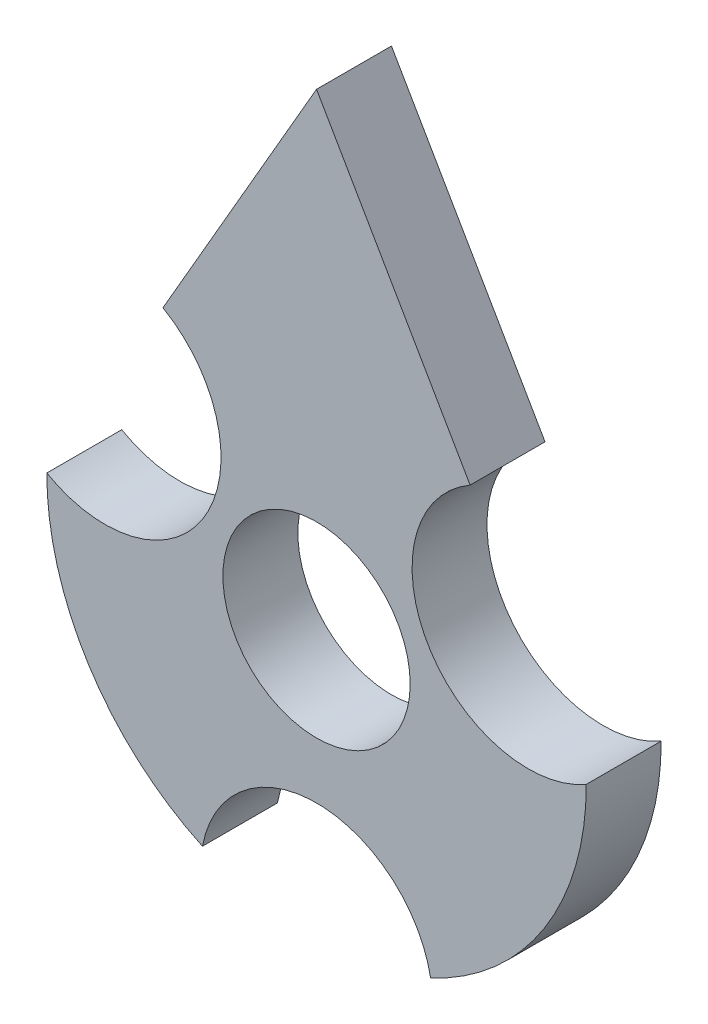
ISO-10303-21;
HEADER;
FILE_DESCRIPTION(('STEP AP214'),'2;1');
FILE_NAME('part.step','',(''),(''),'','','');
FILE_SCHEMA(('AUTOMOTIVE_DESIGN { 1 0 10303 214 1 1 1 1 }'));
ENDSEC;
DATA;
#1=APPLICATION_CONTEXT('core data for automotive mechanical design processes');
#2=APPLICATION_PROTOCOL_DEFINITION('international standard','automotive_design',2000,#1);
#3=PRODUCT_CONTEXT('',#1,'mechanical');
#4=PRODUCT('Part','Part','',(#3));
#5=PRODUCT_RELATED_PRODUCT_CATEGORY('part','',(#4));
#6=PRODUCT_DEFINITION_FORMATION('','',#4);
#7=PRODUCT_DEFINITION_CONTEXT('part definition',#1,'design');
#8=PRODUCT_DEFINITION('design','',#6,#7);
#9=PRODUCT_DEFINITION_SHAPE('','',#8);
#10=(LENGTH_UNIT() NAMED_UNIT(*) SI_UNIT(.MILLI.,.METRE.));
#11=(NAMED_UNIT(*) PLANE_ANGLE_UNIT() SI_UNIT($,.RADIAN.));
#12=(NAMED_UNIT(*) SI_UNIT($,.STERADIAN.) SOLID_ANGLE_UNIT());
#13=UNCERTAINTY_MEASURE_WITH_UNIT(LENGTH_MEASURE(1.E-05),#10,'distance_accuracy_value','');
#14=(GEOMETRIC_REPRESENTATION_CONTEXT(3) GLOBAL_UNCERTAINTY_ASSIGNED_CONTEXT((#13)) GLOBAL_UNIT_ASSIGNED_CONTEXT((#10,
#11,#12)) REPRESENTATION_CONTEXT('',''));
#15=CARTESIAN_POINT('',(0.,0.,0.));
#16=DIRECTION('',(0.,0.,1.));
#17=DIRECTION('',(1.,0.,0.));
#18=AXIS2_PLACEMENT_3D('',#15,#16,#17);
#19=CARTESIAN_POINT('',(0.,-71.,10.));
#20=DIRECTION('',(0.,0.,-1.));
#21=DIRECTION('',(-1.,0.,0.));
#22=AXIS2_PLACEMENT_3D('',#19,#20,#21);
#23=CYLINDRICAL_SURFACE('',#22,31.);
#24=CARTESIAN_POINT('',(0.,-71.,-10.));
#25=DIRECTION('',(0.,0.,1.));
#26=DIRECTION('',(1.,0.,0.));
#27=AXIS2_PLACEMENT_3D('',#24,#25,#26);
#28=CIRCLE('',#27,31.);
#29=CARTESIAN_POINT('',(30.4600707409185,-65.2394366197183,-10.));
#30=VERTEX_POINT('',#29);
#31=CARTESIAN_POINT('',(-30.4600707409185,-65.2394366197183,-10.));
#32=VERTEX_POINT('',#31);
#33=EDGE_CURVE('E140',#30,#32,#28,.T.);
#34=ORIENTED_EDGE('',*,*,#33,.F.);
#35=DIRECTION('',(0.,0.,-1.));
#36=VECTOR('',#35,1.);
#37=CARTESIAN_POINT('',(30.4600707409185,-65.2394366197183,10.));
#38=LINE('',#37,#36);
#39=CARTESIAN_POINT('',(30.4600707409185,-65.2394366197183,10.));
#40=VERTEX_POINT('',#39);
#41=EDGE_CURVE('E11',#40,#30,#38,.T.);
#42=ORIENTED_EDGE('',*,*,#41,.F.);
#43=CARTESIAN_POINT('',(0.,-71.,10.));
#44=DIRECTION('',(0.,0.,1.));
#45=DIRECTION('',(1.,0.,0.));
#46=AXIS2_PLACEMENT_3D('',#43,#44,#45);
#47=CIRCLE('',#46,31.);
#48=CARTESIAN_POINT('',(-30.4600707409185,-65.2394366197183,10.));
#49=VERTEX_POINT('',#48);
#50=EDGE_CURVE('E187',#40,#49,#47,.T.);
#51=ORIENTED_EDGE('',*,*,#50,.T.);
#52=DIRECTION('',(0.,0.,-1.));
#53=VECTOR('',#52,1.);
#54=CARTESIAN_POINT('',(-30.4600707409185,-65.2394366197183,10.));
#55=LINE('',#54,#53);
#56=EDGE_CURVE('E81',#49,#32,#55,.T.);
#57=ORIENTED_EDGE('',*,*,#56,.T.);
#58=EDGE_LOOP('',(#34,#42,#51,#57));
#59=FACE_BOUND('',#58,.T.);
#60=ADVANCED_FACE('F33',(#59),#23,.F.);
#61=CARTESIAN_POINT('',(0.,0.,10.));
#62=DIRECTION('',(0.,0.,-1.));
#63=DIRECTION('',(-1.,0.,0.));
#64=AXIS2_PLACEMENT_3D('',#61,#62,#63);
#65=CYLINDRICAL_SURFACE('',#64,72.);
#66=CARTESIAN_POINT('',(0.,0.,-10.));
#67=DIRECTION('',(0.,0.,1.));
#68=DIRECTION('',(1.,0.,0.));
#69=AXIS2_PLACEMENT_3D('',#66,#67,#68);
#70=CIRCLE('',#69,72.);
#71=CARTESIAN_POINT('',(71.9994078864265,0.292000006815826,-10.));
#72=VERTEX_POINT('',#71);
#73=EDGE_CURVE('E138',#30,#72,#70,.T.);
#74=ORIENTED_EDGE('',*,*,#73,.T.);
#75=DIRECTION('',(0.,0.,-1.));
#76=VECTOR('',#75,1.);
#77=CARTESIAN_POINT('',(71.9994078864265,0.292000006815826,10.));
#78=LINE('',#77,#76);
#79=CARTESIAN_POINT('',(71.9994078864265,0.292000006815826,10.));
#80=VERTEX_POINT('',#79);
#81=EDGE_CURVE('E42',#80,#72,#78,.T.);
#82=ORIENTED_EDGE('',*,*,#81,.F.);
#83=CARTESIAN_POINT('',(0.,0.,10.));
#84=DIRECTION('',(0.,0.,1.));
#85=DIRECTION('',(1.,0.,0.));
#86=AXIS2_PLACEMENT_3D('',#83,#84,#85);
#87=CIRCLE('',#86,72.);
#88=EDGE_CURVE('E189',#40,#80,#87,.T.);
#89=ORIENTED_EDGE('',*,*,#88,.F.);
#90=ORIENTED_EDGE('',*,*,#41,.T.);
#91=EDGE_LOOP('',(#74,#82,#89,#90));
#92=FACE_BOUND('',#91,.T.);
#93=ADVANCED_FACE('F139',(#92),#65,.T.);
#94=CARTESIAN_POINT('',(56.5000000000001,27.1391293723585,10.));
#95=DIRECTION('',(0.,0.,-1.));
#96=DIRECTION('',(-1.,0.,0.));
#97=AXIS2_PLACEMENT_3D('',#94,#95,#96);
#98=CYLINDRICAL_SURFACE('',#97,31.);
#99=CARTESIAN_POINT('',(56.5000000000001,27.1391293723585,-10.));
#100=DIRECTION('',(0.,0.,1.));
#101=DIRECTION('',(1.,0.,0.));
#102=AXIS2_PLACEMENT_3D('',#99,#100,#101);
#103=CIRCLE('',#102,31.);
#104=CARTESIAN_POINT('',(41.0000000000001,53.9859168896761,-10.));
#105=VERTEX_POINT('',#104);
#106=EDGE_CURVE('E133',#105,#72,#103,.T.);
#107=ORIENTED_EDGE('',*,*,#106,.F.);
#108=DIRECTION('',(0.,0.,-1.));
#109=VECTOR('',#108,1.);
#110=CARTESIAN_POINT('',(41.0000000000001,53.9859168896761,10.));
#111=LINE('',#110,#109);
#112=CARTESIAN_POINT('',(41.0000000000001,53.9859168896761,10.));
#113=VERTEX_POINT('',#112);
#114=EDGE_CURVE('E121',#113,#105,#111,.T.);
#115=ORIENTED_EDGE('',*,*,#114,.F.);
#116=CARTESIAN_POINT('',(56.5000000000001,27.1391293723585,10.));
#117=DIRECTION('',(0.,0.,1.));
#118=DIRECTION('',(1.,0.,0.));
#119=AXIS2_PLACEMENT_3D('',#116,#117,#118);
#120=CIRCLE('',#119,31.);
#121=EDGE_CURVE('E135',#113,#80,#120,.T.);
#122=ORIENTED_EDGE('',*,*,#121,.T.);
#123=ORIENTED_EDGE('',*,*,#81,.T.);
#124=EDGE_LOOP('',(#107,#115,#122,#123));
#125=FACE_BOUND('',#124,.T.);
#126=ADVANCED_FACE('F131',(#125),#98,.F.);
#127=CARTESIAN_POINT('',(54.1265877365275,31.2500000000001,10.));
#128=DIRECTION('',(0.866025403784438,0.500000000000001,0.));
#129=DIRECTION('',(-0.500000000000001,0.866025403784438,0.));
#130=AXIS2_PLACEMENT_3D('',#127,#128,#129);
#131=PLANE('',#130);
#132=DIRECTION('',(0.500000000000001,-0.866025403784438,0.));
#133=VECTOR('',#132,1.);
#134=CARTESIAN_POINT('',(54.1265877365275,31.2500000000001,-10.));
#135=LINE('',#134,#133);
#136=CARTESIAN_POINT('',(0.,125.,-10.));
#137=VERTEX_POINT('',#136);
#138=EDGE_CURVE('E144',#137,#105,#135,.T.);
#139=ORIENTED_EDGE('',*,*,#138,.F.);
#140=DIRECTION('',(0.,0.,-1.));
#141=VECTOR('',#140,1.);
#142=CARTESIAN_POINT('',(0.,125.,10.));
#143=LINE('',#142,#141);
#144=CARTESIAN_POINT('',(0.,125.,10.));
#145=VERTEX_POINT('',#144);
#146=EDGE_CURVE('E119',#145,#137,#143,.T.);
#147=ORIENTED_EDGE('',*,*,#146,.F.);
#148=DIRECTION('',(0.500000000000001,-0.866025403784438,0.));
#149=VECTOR('',#148,1.);
#150=CARTESIAN_POINT('',(54.1265877365275,31.2500000000001,10.));
#151=LINE('',#150,#149);
#152=EDGE_CURVE('E113',#145,#113,#151,.T.);
#153=ORIENTED_EDGE('',*,*,#152,.T.);
#154=ORIENTED_EDGE('',*,*,#114,.T.);
#155=EDGE_LOOP('',(#139,#147,#153,#154));
#156=FACE_BOUND('',#155,.T.);
#157=ADVANCED_FACE('F165',(#156),#131,.T.);
#158=CARTESIAN_POINT('',(-54.1265877365275,31.2500000000002,10.));
#159=DIRECTION('',(0.866025403784438,-0.500000000000001,0.));
#160=DIRECTION('',(0.500000000000001,0.866025403784438,0.));
#161=AXIS2_PLACEMENT_3D('',#158,#159,#160);
#162=PLANE('',#161);
#163=DIRECTION('',(-0.500000000000001,-0.866025403784438,0.));
#164=VECTOR('',#163,1.);
#165=CARTESIAN_POINT('',(-54.1265877365275,31.2500000000002,-10.));
#166=LINE('',#165,#164);
#167=CARTESIAN_POINT('',(-41.0000000000001,53.9859168896761,-10.));
#168=VERTEX_POINT('',#167);
#169=EDGE_CURVE('E118',#137,#168,#166,.T.);
#170=ORIENTED_EDGE('',*,*,#169,.T.);
#171=DIRECTION('',(0.,0.,-1.));
#172=VECTOR('',#171,1.);
#173=CARTESIAN_POINT('',(-41.0000000000001,53.9859168896761,10.));
#174=LINE('',#173,#172);
#175=CARTESIAN_POINT('',(-41.0000000000001,53.9859168896761,10.));
#176=VERTEX_POINT('',#175);
#177=EDGE_CURVE('E103',#176,#168,#174,.T.);
#178=ORIENTED_EDGE('',*,*,#177,.F.);
#179=DIRECTION('',(-0.500000000000001,-0.866025403784438,0.));
#180=VECTOR('',#179,1.);
#181=CARTESIAN_POINT('',(-54.1265877365275,31.2500000000002,10.));
#182=LINE('',#181,#180);
#183=EDGE_CURVE('E106',#145,#176,#182,.T.);
#184=ORIENTED_EDGE('',*,*,#183,.F.);
#185=ORIENTED_EDGE('',*,*,#146,.T.);
#186=EDGE_LOOP('',(#170,#178,#184,#185));
#187=FACE_BOUND('',#186,.T.);
#188=ADVANCED_FACE('F116',(#187),#162,.F.);
#189=CARTESIAN_POINT('',(-56.5000000000001,27.1391293723585,10.));
#190=DIRECTION('',(0.,0.,-1.));
#191=DIRECTION('',(-1.,0.,0.));
#192=AXIS2_PLACEMENT_3D('',#189,#190,#191);
#193=CYLINDRICAL_SURFACE('',#192,31.);
#194=CARTESIAN_POINT('',(-56.5000000000001,27.1391293723585,-10.));
#195=DIRECTION('',(0.,0.,1.));
#196=DIRECTION('',(1.,0.,0.));
#197=AXIS2_PLACEMENT_3D('',#194,#195,#196);
#198=CIRCLE('',#197,31.);
#199=CARTESIAN_POINT('',(-71.9994078864265,0.292000006815809,-10.));
#200=VERTEX_POINT('',#199);
#201=EDGE_CURVE('E150',#168,#200,#198,.F.);
#202=ORIENTED_EDGE('',*,*,#201,.T.);
#203=DIRECTION('',(0.,0.,-1.));
#204=VECTOR('',#203,1.);
#205=CARTESIAN_POINT('',(-71.9994078864265,0.292000006815809,10.));
#206=LINE('',#205,#204);
#207=CARTESIAN_POINT('',(-71.9994078864265,0.292000006815809,10.));
#208=VERTEX_POINT('',#207);
#209=EDGE_CURVE('E105',#208,#200,#206,.T.);
#210=ORIENTED_EDGE('',*,*,#209,.F.);
#211=CARTESIAN_POINT('',(-56.5000000000001,27.1391293723585,10.));
#212=DIRECTION('',(0.,0.,1.));
#213=DIRECTION('',(1.,0.,0.));
#214=AXIS2_PLACEMENT_3D('',#211,#212,#213);
#215=CIRCLE('',#214,31.);
#216=EDGE_CURVE('E98',#176,#208,#215,.F.);
#217=ORIENTED_EDGE('',*,*,#216,.F.);
#218=ORIENTED_EDGE('',*,*,#177,.T.);
#219=EDGE_LOOP('',(#202,#210,#217,#218));
#220=FACE_BOUND('',#219,.T.);
#221=ADVANCED_FACE('F101',(#220),#193,.F.);
#222=CARTESIAN_POINT('',(0.,0.,10.));
#223=DIRECTION('',(0.,0.,-1.));
#224=DIRECTION('',(-1.,0.,0.));
#225=AXIS2_PLACEMENT_3D('',#222,#223,#224);
#226=CYLINDRICAL_SURFACE('',#225,25.);
#227=CARTESIAN_POINT('',(0.,0.,10.));
#228=DIRECTION('',(0.,0.,1.));
#229=DIRECTION('',(1.,0.,0.));
#230=AXIS2_PLACEMENT_3D('',#227,#228,#229);
#231=CIRCLE('',#230,25.);
#232=CARTESIAN_POINT('',(25.,0.,10.));
#233=VERTEX_POINT('',#232);
#234=EDGE_CURVE('E152',#233,#233,#231,.T.);
#235=ORIENTED_EDGE('',*,*,#234,.T.);
#236=EDGE_LOOP('',(#235));
#237=FACE_BOUND('',#236,.T.);
#238=CARTESIAN_POINT('',(0.,0.,-10.));
#239=DIRECTION('',(0.,0.,1.));
#240=DIRECTION('',(1.,0.,0.));
#241=AXIS2_PLACEMENT_3D('',#238,#239,#240);
#242=CIRCLE('',#241,25.);
#243=CARTESIAN_POINT('',(25.,0.,-10.));
#244=VERTEX_POINT('',#243);
#245=EDGE_CURVE('E155',#244,#244,#242,.T.);
#246=ORIENTED_EDGE('',*,*,#245,.F.);
#247=EDGE_LOOP('',(#246));
#248=FACE_BOUND('',#247,.T.);
#249=ADVANCED_FACE('F35',(#237,#248),#226,.F.);
#250=CARTESIAN_POINT('',(0.,0.,10.));
#251=DIRECTION('',(0.,0.,-1.));
#252=DIRECTION('',(-1.,0.,0.));
#253=AXIS2_PLACEMENT_3D('',#250,#251,#252);
#254=CYLINDRICAL_SURFACE('',#253,72.);
#255=CARTESIAN_POINT('',(0.,0.,-10.));
#256=DIRECTION('',(0.,0.,1.));
#257=DIRECTION('',(1.,0.,0.));
#258=AXIS2_PLACEMENT_3D('',#255,#256,#257);
#259=CIRCLE('',#258,72.);
#260=EDGE_CURVE('E74',#200,#32,#259,.T.);
#261=ORIENTED_EDGE('',*,*,#260,.T.);
#262=ORIENTED_EDGE('',*,*,#56,.F.);
#263=CARTESIAN_POINT('',(0.,0.,10.));
#264=DIRECTION('',(0.,0.,1.));
#265=DIRECTION('',(1.,0.,0.));
#266=AXIS2_PLACEMENT_3D('',#263,#264,#265);
#267=CIRCLE('',#266,72.);
#268=EDGE_CURVE('E50',#208,#49,#267,.T.);
#269=ORIENTED_EDGE('',*,*,#268,.F.);
#270=ORIENTED_EDGE('',*,*,#209,.T.);
#271=EDGE_LOOP('',(#261,#262,#269,#270));
#272=FACE_BOUND('',#271,.T.);
#273=ADVANCED_FACE('F173',(#272),#254,.T.);
#274=CARTESIAN_POINT('',(0.,0.,10.));
#275=DIRECTION('',(0.,0.,1.));
#276=DIRECTION('',(1.,0.,0.));
#277=AXIS2_PLACEMENT_3D('',#274,#275,#276);
#278=PLANE('',#277);
#279=ORIENTED_EDGE('',*,*,#234,.F.);
#280=EDGE_LOOP('',(#279));
#281=FACE_BOUND('',#280,.T.);
#282=ORIENTED_EDGE('',*,*,#50,.F.);
#283=ORIENTED_EDGE('',*,*,#88,.T.);
#284=ORIENTED_EDGE('',*,*,#121,.F.);
#285=ORIENTED_EDGE('',*,*,#152,.F.);
#286=ORIENTED_EDGE('',*,*,#183,.T.);
#287=ORIENTED_EDGE('',*,*,#216,.T.);
#288=ORIENTED_EDGE('',*,*,#268,.T.);
#289=EDGE_LOOP('',(#282,#283,#284,#285,#286,#287,#288));
#290=FACE_BOUND('',#289,.T.);
#291=ADVANCED_FACE('F110',(#281,#290),#278,.T.);
#292=CARTESIAN_POINT('',(0.,0.,-10.));
#293=DIRECTION('',(0.,0.,1.));
#294=DIRECTION('',(1.,0.,0.));
#295=AXIS2_PLACEMENT_3D('',#292,#293,#294);
#296=PLANE('',#295);
#297=ORIENTED_EDGE('',*,*,#245,.T.);
#298=EDGE_LOOP('',(#297));
#299=FACE_BOUND('',#298,.T.);
#300=ORIENTED_EDGE('',*,*,#33,.T.);
#301=ORIENTED_EDGE('',*,*,#260,.F.);
#302=ORIENTED_EDGE('',*,*,#201,.F.);
#303=ORIENTED_EDGE('',*,*,#169,.F.);
#304=ORIENTED_EDGE('',*,*,#138,.T.);
#305=ORIENTED_EDGE('',*,*,#106,.T.);
#306=ORIENTED_EDGE('',*,*,#73,.F.);
#307=EDGE_LOOP('',(#300,#301,#302,#303,#304,#305,#306));
#308=FACE_BOUND('',#307,.T.);
#309=ADVANCED_FACE('F142',(#299,#308),#296,.F.);
#310=CLOSED_SHELL('',(#60,#93,#126,#157,#188,#221,#249,#273,#291,#309));
#311=MANIFOLD_SOLID_BREP('B2',#310);
#312=ADVANCED_BREP_SHAPE_REPRESENTATION('',(#18,#311),#14);
#313=SHAPE_DEFINITION_REPRESENTATION(#9,#312);
ENDSEC;
END-ISO-10303-21;
